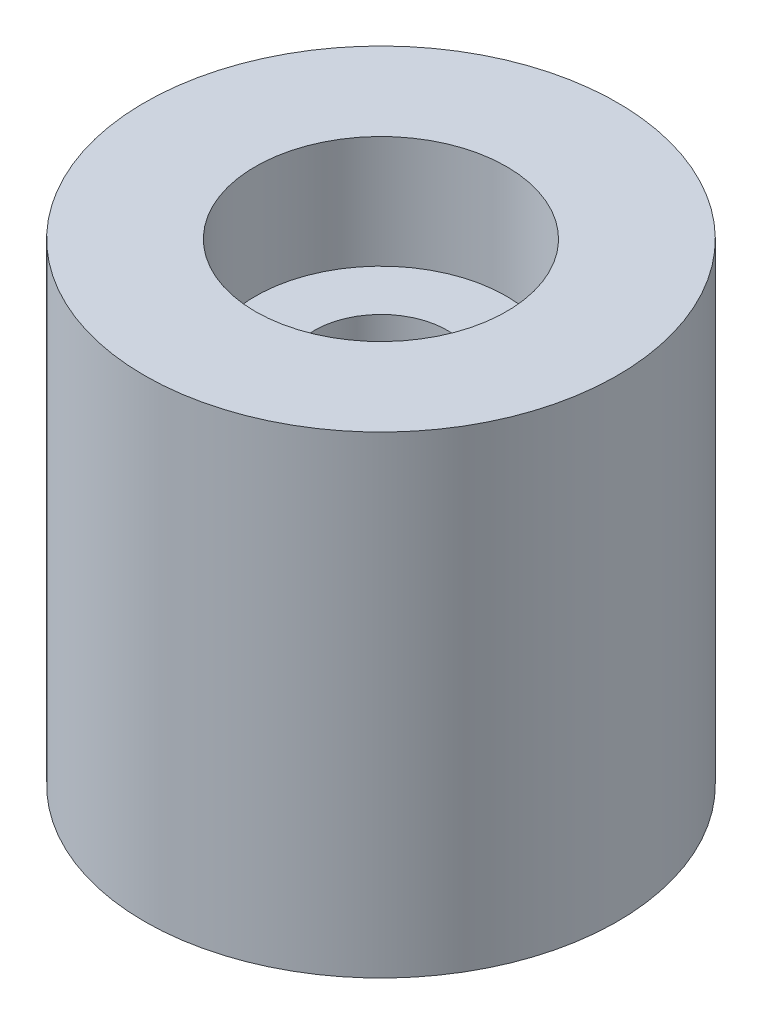
ISO-10303-21;
HEADER;
FILE_DESCRIPTION(('STEP AP214'),'2;1');
FILE_NAME('part.step','',(''),(''),'','','');
FILE_SCHEMA(('AUTOMOTIVE_DESIGN { 1 0 10303 214 1 1 1 1 }'));
ENDSEC;
DATA;
#1=APPLICATION_CONTEXT('core data for automotive mechanical design processes');
#2=APPLICATION_PROTOCOL_DEFINITION('international standard','automotive_design',2000,#1);
#3=PRODUCT_CONTEXT('',#1,'mechanical');
#4=PRODUCT('Part','Part','',(#3));
#5=PRODUCT_RELATED_PRODUCT_CATEGORY('part','',(#4));
#6=PRODUCT_DEFINITION_FORMATION('','',#4);
#7=PRODUCT_DEFINITION_CONTEXT('part definition',#1,'design');
#8=PRODUCT_DEFINITION('design','',#6,#7);
#9=PRODUCT_DEFINITION_SHAPE('','',#8);
#10=(LENGTH_UNIT() NAMED_UNIT(*) SI_UNIT(.MILLI.,.METRE.));
#11=(NAMED_UNIT(*) PLANE_ANGLE_UNIT() SI_UNIT($,.RADIAN.));
#12=(NAMED_UNIT(*) SI_UNIT($,.STERADIAN.) SOLID_ANGLE_UNIT());
#13=UNCERTAINTY_MEASURE_WITH_UNIT(LENGTH_MEASURE(1.E-05),#10,'distance_accuracy_value','');
#14=(GEOMETRIC_REPRESENTATION_CONTEXT(3) GLOBAL_UNCERTAINTY_ASSIGNED_CONTEXT((#13)) GLOBAL_UNIT_ASSIGNED_CONTEXT((#10,
#11,#12)) REPRESENTATION_CONTEXT('',''));
#15=CARTESIAN_POINT('',(0.,0.,0.));
#16=DIRECTION('',(0.,0.,1.));
#17=DIRECTION('',(1.,0.,0.));
#18=AXIS2_PLACEMENT_3D('',#15,#16,#17);
#19=CARTESIAN_POINT('',(0.,16.,0.));
#20=DIRECTION('',(0.,-1.,0.));
#21=DIRECTION('',(0.,0.,-1.));
#22=AXIS2_PLACEMENT_3D('',#19,#20,#21);
#23=CYLINDRICAL_SURFACE('',#22,2.25);
#24=CARTESIAN_POINT('',(0.,0.,0.));
#25=DIRECTION('',(0.,1.,0.));
#26=DIRECTION('',(0.,0.,1.));
#27=AXIS2_PLACEMENT_3D('',#24,#25,#26);
#28=CIRCLE('',#27,2.25);
#29=CARTESIAN_POINT('',(0.,0.,2.25));
#30=VERTEX_POINT('',#29);
#31=EDGE_CURVE('E44',#30,#30,#28,.T.);
#32=ORIENTED_EDGE('',*,*,#31,.F.);
#33=EDGE_LOOP('',(#32));
#34=FACE_BOUND('',#33,.T.);
#35=CARTESIAN_POINT('',(0.,12.2,0.));
#36=DIRECTION('',(0.,1.,0.));
#37=DIRECTION('',(0.,0.,1.));
#38=AXIS2_PLACEMENT_3D('',#35,#36,#37);
#39=CIRCLE('',#38,2.25);
#40=CARTESIAN_POINT('',(0.,12.2,2.25));
#41=VERTEX_POINT('',#40);
#42=EDGE_CURVE('E35',#41,#41,#39,.T.);
#43=ORIENTED_EDGE('',*,*,#42,.T.);
#44=EDGE_LOOP('',(#43));
#45=FACE_BOUND('',#44,.T.);
#46=ADVANCED_FACE('F31',(#34,#45),#23,.F.);
#47=CARTESIAN_POINT('',(0.,16.,0.));
#48=DIRECTION('',(0.,1.,0.));
#49=DIRECTION('',(0.,0.,1.));
#50=AXIS2_PLACEMENT_3D('',#47,#48,#49);
#51=PLANE('',#50);
#52=CARTESIAN_POINT('',(0.,16.,0.));
#53=DIRECTION('',(0.,1.,0.));
#54=DIRECTION('',(0.,0.,1.));
#55=AXIS2_PLACEMENT_3D('',#52,#53,#54);
#56=CIRCLE('',#55,4.25);
#57=CARTESIAN_POINT('',(0.,16.,4.25));
#58=VERTEX_POINT('',#57);
#59=EDGE_CURVE('E48',#58,#58,#56,.T.);
#60=ORIENTED_EDGE('',*,*,#59,.F.);
#61=EDGE_LOOP('',(#60));
#62=FACE_BOUND('',#61,.T.);
#63=CARTESIAN_POINT('',(0.,16.,0.));
#64=DIRECTION('',(0.,1.,0.));
#65=DIRECTION('',(0.,0.,1.));
#66=AXIS2_PLACEMENT_3D('',#63,#64,#65);
#67=CIRCLE('',#66,8.);
#68=CARTESIAN_POINT('',(0.,16.,8.));
#69=VERTEX_POINT('',#68);
#70=EDGE_CURVE('E10',#69,#69,#67,.T.);
#71=ORIENTED_EDGE('',*,*,#70,.T.);
#72=EDGE_LOOP('',(#71));
#73=FACE_BOUND('',#72,.T.);
#74=ADVANCED_FACE('F69',(#62,#73),#51,.T.);
#75=CARTESIAN_POINT('',(0.,0.,0.));
#76=DIRECTION('',(0.,1.,0.));
#77=DIRECTION('',(0.,0.,1.));
#78=AXIS2_PLACEMENT_3D('',#75,#76,#77);
#79=PLANE('',#78);
#80=CARTESIAN_POINT('',(0.,0.,0.));
#81=DIRECTION('',(0.,1.,0.));
#82=DIRECTION('',(0.,0.,1.));
#83=AXIS2_PLACEMENT_3D('',#80,#81,#82);
#84=CIRCLE('',#83,8.);
#85=CARTESIAN_POINT('',(0.,0.,8.));
#86=VERTEX_POINT('',#85);
#87=EDGE_CURVE('E39',#86,#86,#84,.T.);
#88=ORIENTED_EDGE('',*,*,#87,.F.);
#89=EDGE_LOOP('',(#88));
#90=FACE_BOUND('',#89,.T.);
#91=ORIENTED_EDGE('',*,*,#31,.T.);
#92=EDGE_LOOP('',(#91));
#93=FACE_BOUND('',#92,.T.);
#94=ADVANCED_FACE('F75',(#90,#93),#79,.F.);
#95=CARTESIAN_POINT('',(0.,16.,0.));
#96=DIRECTION('',(0.,-1.,0.));
#97=DIRECTION('',(0.,0.,-1.));
#98=AXIS2_PLACEMENT_3D('',#95,#96,#97);
#99=CYLINDRICAL_SURFACE('',#98,8.);
#100=ORIENTED_EDGE('',*,*,#70,.F.);
#101=EDGE_LOOP('',(#100));
#102=FACE_BOUND('',#101,.T.);
#103=ORIENTED_EDGE('',*,*,#87,.T.);
#104=EDGE_LOOP('',(#103));
#105=FACE_BOUND('',#104,.T.);
#106=ADVANCED_FACE('F33',(#102,#105),#99,.T.);
#107=CARTESIAN_POINT('',(0.,12.2,0.));
#108=DIRECTION('',(0.,1.,0.));
#109=DIRECTION('',(0.,0.,1.));
#110=AXIS2_PLACEMENT_3D('',#107,#108,#109);
#111=CYLINDRICAL_SURFACE('',#110,4.25);
#112=CARTESIAN_POINT('',(0.,12.2,0.));
#113=DIRECTION('',(0.,1.,0.));
#114=DIRECTION('',(0.,0.,1.));
#115=AXIS2_PLACEMENT_3D('',#112,#113,#114);
#116=CIRCLE('',#115,4.25);
#117=CARTESIAN_POINT('',(0.,12.2,4.25));
#118=VERTEX_POINT('',#117);
#119=EDGE_CURVE('E51',#118,#118,#116,.T.);
#120=ORIENTED_EDGE('',*,*,#119,.F.);
#121=EDGE_LOOP('',(#120));
#122=FACE_BOUND('',#121,.T.);
#123=ORIENTED_EDGE('',*,*,#59,.T.);
#124=EDGE_LOOP('',(#123));
#125=FACE_BOUND('',#124,.T.);
#126=ADVANCED_FACE('F61',(#122,#125),#111,.F.);
#127=CARTESIAN_POINT('',(0.,12.2,0.));
#128=DIRECTION('',(0.,1.,0.));
#129=DIRECTION('',(0.,0.,1.));
#130=AXIS2_PLACEMENT_3D('',#127,#128,#129);
#131=PLANE('',#130);
#132=ORIENTED_EDGE('',*,*,#42,.F.);
#133=EDGE_LOOP('',(#132));
#134=FACE_BOUND('',#133,.T.);
#135=ORIENTED_EDGE('',*,*,#119,.T.);
#136=EDGE_LOOP('',(#135));
#137=FACE_BOUND('',#136,.T.);
#138=ADVANCED_FACE('F59',(#134,#137),#131,.T.);
#139=CLOSED_SHELL('',(#46,#74,#94,#106,#126,#138));
#140=MANIFOLD_SOLID_BREP('B2',#139);
#141=ADVANCED_BREP_SHAPE_REPRESENTATION('',(#18,#140),#14);
#142=SHAPE_DEFINITION_REPRESENTATION(#9,#141);
ENDSEC;
END-ISO-10303-21;
